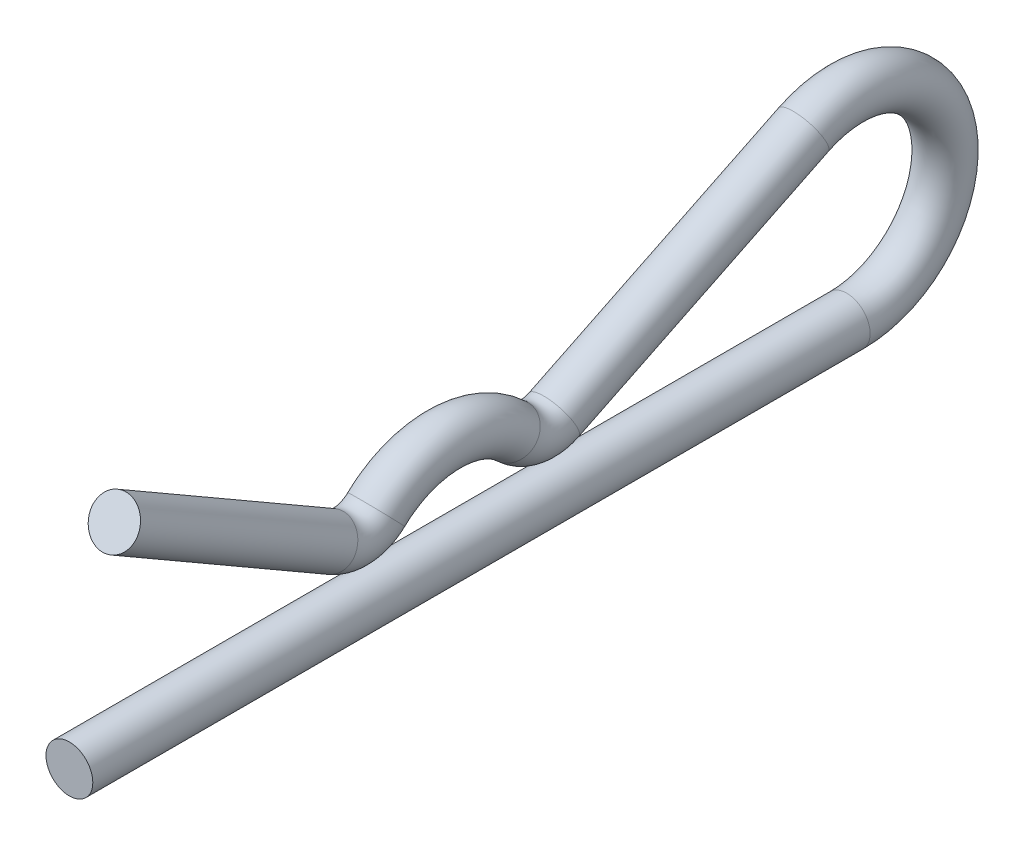
ISO-10303-21;
HEADER;
FILE_DESCRIPTION(('STEP AP214'),'2;1');
FILE_NAME('part.step','',(''),(''),'','','');
FILE_SCHEMA(('AUTOMOTIVE_DESIGN { 1 0 10303 214 1 1 1 1 }'));
ENDSEC;
DATA;
#1=APPLICATION_CONTEXT('core data for automotive mechanical design processes');
#2=APPLICATION_PROTOCOL_DEFINITION('international standard','automotive_design',2000,#1);
#3=PRODUCT_CONTEXT('',#1,'mechanical');
#4=PRODUCT('Part','Part','',(#3));
#5=PRODUCT_RELATED_PRODUCT_CATEGORY('part','',(#4));
#6=PRODUCT_DEFINITION_FORMATION('','',#4);
#7=PRODUCT_DEFINITION_CONTEXT('part definition',#1,'design');
#8=PRODUCT_DEFINITION('design','',#6,#7);
#9=PRODUCT_DEFINITION_SHAPE('','',#8);
#10=(LENGTH_UNIT() NAMED_UNIT(*) SI_UNIT(.MILLI.,.METRE.));
#11=(NAMED_UNIT(*) PLANE_ANGLE_UNIT() SI_UNIT($,.RADIAN.));
#12=(NAMED_UNIT(*) SI_UNIT($,.STERADIAN.) SOLID_ANGLE_UNIT());
#13=UNCERTAINTY_MEASURE_WITH_UNIT(LENGTH_MEASURE(1.E-05),#10,'distance_accuracy_value','');
#14=(GEOMETRIC_REPRESENTATION_CONTEXT(3) GLOBAL_UNCERTAINTY_ASSIGNED_CONTEXT((#13)) GLOBAL_UNIT_ASSIGNED_CONTEXT((#10,
#11,#12)) REPRESENTATION_CONTEXT('',''));
#15=CARTESIAN_POINT('',(0.,0.,0.));
#16=DIRECTION('',(0.,0.,1.));
#17=DIRECTION('',(1.,0.,0.));
#18=AXIS2_PLACEMENT_3D('',#15,#16,#17);
#19=CARTESIAN_POINT('',(0.,2.79237217149186,-11.1124999999996));
#20=DIRECTION('',(0.,0.499999999999991,0.866025403784442));
#21=DIRECTION('',(0.,-0.866025403784443,0.49999999999999));
#22=AXIS2_PLACEMENT_3D('',#19,#20,#21);
#23=CYLINDRICAL_SURFACE('',#22,0.9921875);
#24=CARTESIAN_POINT('',(0.,2.79237217149186,-11.1124999999996));
#25=DIRECTION('',(0.,-0.499999999999976,-0.866025403784451));
#26=DIRECTION('',(0.999999999999999,0.,0.));
#27=AXIS2_PLACEMENT_3D('',#24,#25,#26);
#28=CIRCLE('',#27,0.9921875);
#29=CARTESIAN_POINT('',(0.,1.93311259117495,-10.6164062499998));
#30=VERTEX_POINT('',#29);
#31=EDGE_CURVE('E46',#30,#30,#28,.T.);
#32=ORIENTED_EDGE('',*,*,#31,.F.);
#33=EDGE_LOOP('',(#32));
#34=FACE_BOUND('',#33,.T.);
#35=CARTESIAN_POINT('',(0.,8.10832477505563,-1.90499999999982));
#36=DIRECTION('',(0.,-0.499999999999976,-0.866025403784451));
#37=DIRECTION('',(0.999999999999999,0.,0.));
#38=AXIS2_PLACEMENT_3D('',#35,#36,#37);
#39=CIRCLE('',#38,0.9921875);
#40=CARTESIAN_POINT('',(0.992187499999999,8.10832477505563,-1.90499999999982));
#41=VERTEX_POINT('',#40);
#42=EDGE_CURVE('E12',#41,#41,#39,.T.);
#43=ORIENTED_EDGE('',*,*,#42,.T.);
#44=EDGE_LOOP('',(#43));
#45=FACE_BOUND('',#44,.T.);
#46=ADVANCED_FACE('F40',(#34,#45),#23,.T.);
#47=CARTESIAN_POINT('',(0.,4.1671875,-11.90625));
#48=DIRECTION('',(-0.999999999999999,0.,0.));
#49=DIRECTION('',(0.,0.,0.999999999999998));
#50=AXIS2_PLACEMENT_3D('',#47,#48,#49);
#51=TOROIDAL_SURFACE('',#50,1.58750000000001,0.9921875);
#52=CARTESIAN_POINT('',(0.,3.01761853448268,-13.0010775862066));
#53=DIRECTION('',(0.,0.689655172413805,-0.724137931034469));
#54=DIRECTION('',(0.999999999999999,0.,0.));
#55=AXIS2_PLACEMENT_3D('',#52,#53,#54);
#56=CIRCLE('',#55,0.9921875);
#57=CARTESIAN_POINT('',(1.12757025938503E-13,2.29913793103418,-13.6853448275859));
#58=VERTEX_POINT('',#57);
#59=EDGE_CURVE('E50',#58,#58,#56,.T.);
#60=CARTESIAN_POINT('',(0.,4.1671875,-11.90625));
#61=DIRECTION('',(-0.999999999999999,0.,0.));
#62=DIRECTION('',(0.,0.,0.999999999999998));
#63=AXIS2_PLACEMENT_3D('',#60,#61,#62);
#64=CIRCLE('',#63,2.57968750000001);
#65=EDGE_CURVE('',#58,#30,#64,.T.);
#66=ORIENTED_EDGE('',*,*,#59,.F.);
#67=ORIENTED_EDGE('',*,*,#31,.T.);
#68=ORIENTED_EDGE('',*,*,#65,.T.);
#69=ORIENTED_EDGE('',*,*,#65,.F.);
#70=EDGE_LOOP('',(#66,#68,#67,#69));
#71=FACE_BOUND('',#70,.T.);
#72=ADVANCED_FACE('F96',(#71),#51,.T.);
#73=CARTESIAN_POINT('',(0.,1.11022302462516E-13,-15.8750000000001));
#74=DIRECTION('',(0.999999999999999,0.,0.));
#75=DIRECTION('',(0.,0.,-0.999999999999998));
#76=AXIS2_PLACEMENT_3D('',#73,#74,#75);
#77=TOROIDAL_SURFACE('',#76,4.16718749999999,0.9921875);
#78=CARTESIAN_POINT('',(0.,3.01761853448279,-18.7489224137931));
#79=DIRECTION('',(0.,-0.689655172413781,-0.724137931034493));
#80=DIRECTION('',(0.999999999999999,0.,0.));
#81=AXIS2_PLACEMENT_3D('',#78,#79,#80);
#82=CIRCLE('',#81,0.9921875);
#83=CARTESIAN_POINT('',(0.,2.29913793103445,-18.0646551724138));
#84=VERTEX_POINT('',#83);
#85=EDGE_CURVE('E54',#84,#84,#82,.T.);
#86=ORIENTED_EDGE('',*,*,#85,.F.);
#87=EDGE_LOOP('',(#86));
#88=FACE_BOUND('',#87,.T.);
#89=ORIENTED_EDGE('',*,*,#59,.T.);
#90=EDGE_LOOP('',(#89));
#91=FACE_BOUND('',#90,.T.);
#92=ADVANCED_FACE('F90',(#88,#91),#77,.T.);
#93=CARTESIAN_POINT('',(0.,4.1671875,-19.8437499999999));
#94=DIRECTION('',(-0.999999999999999,0.,0.));
#95=DIRECTION('',(0.,0.,0.999999999999998));
#96=AXIS2_PLACEMENT_3D('',#93,#94,#95);
#97=TOROIDAL_SURFACE('',#96,1.5875,0.9921875);
#98=CARTESIAN_POINT('',(0.,2.7411450189867,-20.5412878787878));
#99=DIRECTION('',(0.,0.439393939393953,-0.898294476229182));
#100=DIRECTION('',(0.999999999999999,0.,0.));
#101=AXIS2_PLACEMENT_3D('',#98,#99,#100);
#102=CIRCLE('',#101,0.9921875);
#103=CARTESIAN_POINT('',(1.12757025938526E-13,1.84986846835269,-20.9772490530306));
#104=VERTEX_POINT('',#103);
#105=EDGE_CURVE('E59',#104,#104,#102,.T.);
#106=CARTESIAN_POINT('',(0.,4.1671875,-19.8437499999999));
#107=DIRECTION('',(-0.999999999999999,0.,0.));
#108=DIRECTION('',(0.,0.,0.999999999999998));
#109=AXIS2_PLACEMENT_3D('',#106,#107,#108);
#110=CIRCLE('',#109,2.5796875);
#111=EDGE_CURVE('',#104,#84,#110,.T.);
#112=ORIENTED_EDGE('',*,*,#105,.F.);
#113=ORIENTED_EDGE('',*,*,#85,.T.);
#114=ORIENTED_EDGE('',*,*,#111,.T.);
#115=ORIENTED_EDGE('',*,*,#111,.F.);
#116=EDGE_LOOP('',(#112,#114,#113,#115));
#117=FACE_BOUND('',#116,.T.);
#118=ADVANCED_FACE('F84',(#117),#97,.T.);
#119=CARTESIAN_POINT('',(0.,7.91054901266175,-31.1095880681804));
#120=DIRECTION('',(0.,-0.439393939393939,0.898294476229189));
#121=DIRECTION('',(0.,-0.89829447622919,-0.439393939393938));
#122=AXIS2_PLACEMENT_3D('',#119,#120,#121);
#123=CYLINDRICAL_SURFACE('',#122,0.9921875);
#124=CARTESIAN_POINT('',(0.,7.91054901266175,-31.1095880681804));
#125=DIRECTION('',(0.,0.439393939393953,-0.898294476229182));
#126=DIRECTION('',(0.999999999999999,0.,0.));
#127=AXIS2_PLACEMENT_3D('',#124,#125,#126);
#128=CIRCLE('',#127,0.9921875);
#129=CARTESIAN_POINT('',(0.,8.80182556329451,-30.6736268939382));
#130=VERTEX_POINT('',#129);
#131=EDGE_CURVE('E62',#130,#130,#128,.T.);
#132=ORIENTED_EDGE('',*,*,#131,.F.);
#133=EDGE_LOOP('',(#132));
#134=FACE_BOUND('',#133,.T.);
#135=ORIENTED_EDGE('',*,*,#105,.T.);
#136=EDGE_LOOP('',(#135));
#137=FACE_BOUND('',#136,.T.);
#138=ADVANCED_FACE('F78',(#134,#137),#123,.T.);
#139=CARTESIAN_POINT('',(0.,4.16718750000011,-32.9406249999999));
#140=DIRECTION('',(0.999999999999999,0.,0.));
#141=DIRECTION('',(0.,0.,-0.999999999999998));
#142=AXIS2_PLACEMENT_3D('',#139,#140,#141);
#143=TOROIDAL_SURFACE('',#142,4.16718749999999,0.9921875);
#144=CARTESIAN_POINT('',(0.,1.11022302462516E-13,-32.9406249999999));
#145=DIRECTION('',(0.,0.,0.999999999999998));
#146=DIRECTION('',(0.999999999999999,0.,0.));
#147=AXIS2_PLACEMENT_3D('',#144,#145,#146);
#148=CIRCLE('',#147,0.9921875);
#149=CARTESIAN_POINT('',(0.,-0.99218749999988,-32.9406249999999));
#150=VERTEX_POINT('',#149);
#151=EDGE_CURVE('E65',#150,#150,#148,.T.);
#152=CARTESIAN_POINT('',(0.,4.16718750000011,-32.9406249999999));
#153=DIRECTION('',(0.999999999999999,0.,0.));
#154=DIRECTION('',(0.,0.,-0.999999999999998));
#155=AXIS2_PLACEMENT_3D('',#152,#153,#154);
#156=CIRCLE('',#155,5.15937499999999);
#157=EDGE_CURVE('',#150,#130,#156,.T.);
#158=ORIENTED_EDGE('',*,*,#151,.F.);
#159=ORIENTED_EDGE('',*,*,#131,.T.);
#160=ORIENTED_EDGE('',*,*,#157,.T.);
#161=ORIENTED_EDGE('',*,*,#157,.F.);
#162=EDGE_LOOP('',(#158,#160,#159,#161));
#163=FACE_BOUND('',#162,.T.);
#164=ADVANCED_FACE('F75',(#163),#143,.T.);
#165=CARTESIAN_POINT('',(0.,1.11022302462516E-13,-32.9406249999999));
#166=DIRECTION('',(0.,0.,0.999999999999998));
#167=DIRECTION('',(0.,-0.999999999999999,0.));
#168=AXIS2_PLACEMENT_3D('',#165,#166,#167);
#169=CYLINDRICAL_SURFACE('',#168,0.9921875);
#170=ORIENTED_EDGE('',*,*,#151,.T.);
#171=EDGE_LOOP('',(#170));
#172=FACE_BOUND('',#171,.T.);
#173=CARTESIAN_POINT('',(0.,0.,0.));
#174=DIRECTION('',(0.,0.,0.999999999999998));
#175=DIRECTION('',(0.999999999999999,0.,0.));
#176=AXIS2_PLACEMENT_3D('',#173,#174,#175);
#177=CIRCLE('',#176,0.9921875);
#178=CARTESIAN_POINT('',(0.992187499999999,0.,0.));
#179=VERTEX_POINT('',#178);
#180=EDGE_CURVE('E66',#179,#179,#177,.T.);
#181=ORIENTED_EDGE('',*,*,#180,.F.);
#182=EDGE_LOOP('',(#181));
#183=FACE_BOUND('',#182,.T.);
#184=ADVANCED_FACE('F72',(#172,#183),#169,.T.);
#185=CARTESIAN_POINT('',(0.,8.10832477505563,-1.90499999999982));
#186=DIRECTION('',(0.,-0.499999999999976,-0.866025403784451));
#187=DIRECTION('',(0.999999999999999,0.,0.));
#188=AXIS2_PLACEMENT_3D('',#185,#186,#187);
#189=PLANE('',#188);
#190=ORIENTED_EDGE('',*,*,#42,.F.);
#191=EDGE_LOOP('',(#190));
#192=FACE_BOUND('',#191,.T.);
#193=ADVANCED_FACE('F108',(#192),#189,.F.);
#194=CARTESIAN_POINT('',(0.,0.,0.));
#195=DIRECTION('',(0.,0.,0.999999999999998));
#196=DIRECTION('',(0.999999999999999,0.,0.));
#197=AXIS2_PLACEMENT_3D('',#194,#195,#196);
#198=PLANE('',#197);
#199=ORIENTED_EDGE('',*,*,#180,.T.);
#200=EDGE_LOOP('',(#199));
#201=FACE_BOUND('',#200,.T.);
#202=ADVANCED_FACE('F109',(#201),#198,.T.);
#203=CLOSED_SHELL('',(#46,#72,#92,#118,#138,#164,#184,#193,#202));
#204=MANIFOLD_SOLID_BREP('B2',#203);
#205=ADVANCED_BREP_SHAPE_REPRESENTATION('',(#18,#204),#14);
#206=SHAPE_DEFINITION_REPRESENTATION(#9,#205);
ENDSEC;
END-ISO-10303-21;
